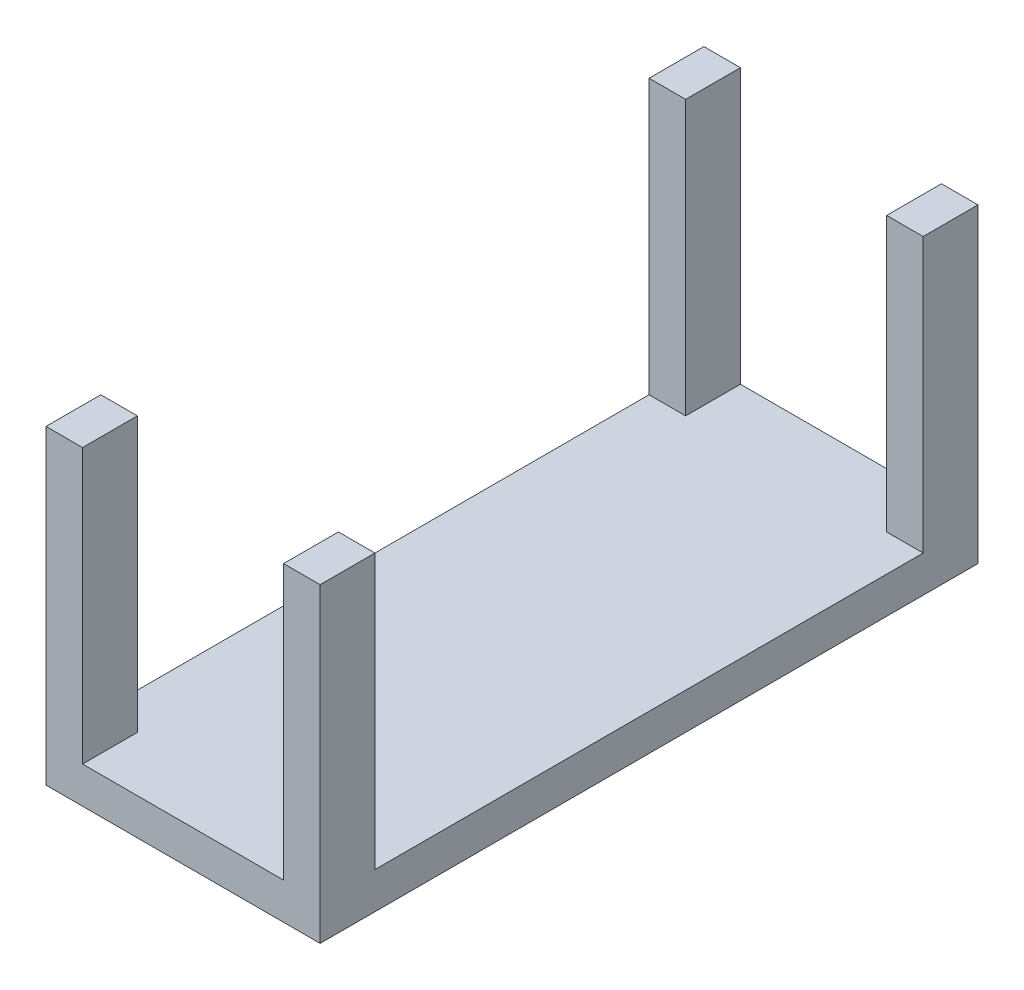
ISO-10303-21;
HEADER;
FILE_DESCRIPTION(('STEP AP214'),'2;1');
FILE_NAME('part.step','',(''),(''),'','','');
FILE_SCHEMA(('AUTOMOTIVE_DESIGN { 1 0 10303 214 1 1 1 1 }'));
ENDSEC;
DATA;
#1=APPLICATION_CONTEXT('core data for automotive mechanical design processes');
#2=APPLICATION_PROTOCOL_DEFINITION('international standard','automotive_design',2000,#1);
#3=PRODUCT_CONTEXT('',#1,'mechanical');
#4=PRODUCT('Part','Part','',(#3));
#5=PRODUCT_RELATED_PRODUCT_CATEGORY('part','',(#4));
#6=PRODUCT_DEFINITION_FORMATION('','',#4);
#7=PRODUCT_DEFINITION_CONTEXT('part definition',#1,'design');
#8=PRODUCT_DEFINITION('design','',#6,#7);
#9=PRODUCT_DEFINITION_SHAPE('','',#8);
#10=(LENGTH_UNIT() NAMED_UNIT(*) SI_UNIT(.MILLI.,.METRE.));
#11=(NAMED_UNIT(*) PLANE_ANGLE_UNIT() SI_UNIT($,.RADIAN.));
#12=(NAMED_UNIT(*) SI_UNIT($,.STERADIAN.) SOLID_ANGLE_UNIT());
#13=UNCERTAINTY_MEASURE_WITH_UNIT(LENGTH_MEASURE(1.E-05),#10,'distance_accuracy_value','');
#14=(GEOMETRIC_REPRESENTATION_CONTEXT(3) GLOBAL_UNCERTAINTY_ASSIGNED_CONTEXT((#13)) GLOBAL_UNIT_ASSIGNED_CONTEXT((#10,
#11,#12)) REPRESENTATION_CONTEXT('',''));
#15=CARTESIAN_POINT('',(0.,0.,0.));
#16=DIRECTION('',(0.,0.,1.));
#17=DIRECTION('',(1.,0.,0.));
#18=AXIS2_PLACEMENT_3D('',#15,#16,#17);
#19=CARTESIAN_POINT('',(7.5,8.5,36.));
#20=DIRECTION('',(0.,-1.,0.));
#21=DIRECTION('',(1.,0.,0.));
#22=AXIS2_PLACEMENT_3D('',#19,#20,#21);
#23=PLANE('',#22);
#24=DIRECTION('',(0.,0.,1.));
#25=VECTOR('',#24,1.);
#26=CARTESIAN_POINT('',(-5.5,8.5,36.));
#27=LINE('',#26,#25);
#28=CARTESIAN_POINT('',(-5.5,8.5,33.));
#29=VERTEX_POINT('',#28);
#30=CARTESIAN_POINT('',(-5.5,8.5,36.));
#31=VERTEX_POINT('',#30);
#32=EDGE_CURVE('E197',#29,#31,#27,.T.);
#33=ORIENTED_EDGE('',*,*,#32,.F.);
#34=DIRECTION('',(1.,0.,0.));
#35=VECTOR('',#34,1.);
#36=CARTESIAN_POINT('',(-7.5,8.5,33.));
#37=LINE('',#36,#35);
#38=CARTESIAN_POINT('',(-7.5,8.5,33.));
#39=VERTEX_POINT('',#38);
#40=EDGE_CURVE('E176',#39,#29,#37,.T.);
#41=ORIENTED_EDGE('',*,*,#40,.F.);
#42=DIRECTION('',(0.,0.,-1.));
#43=VECTOR('',#42,1.);
#44=CARTESIAN_POINT('',(-7.5,8.5,36.));
#45=LINE('',#44,#43);
#46=CARTESIAN_POINT('',(-7.5,8.5,36.));
#47=VERTEX_POINT('',#46);
#48=EDGE_CURVE('E249',#47,#39,#45,.T.);
#49=ORIENTED_EDGE('',*,*,#48,.F.);
#50=DIRECTION('',(-1.,0.,0.));
#51=VECTOR('',#50,1.);
#52=CARTESIAN_POINT('',(7.5,8.5,36.));
#53=LINE('',#52,#51);
#54=EDGE_CURVE('E234',#31,#47,#53,.T.);
#55=ORIENTED_EDGE('',*,*,#54,.F.);
#56=EDGE_LOOP('',(#33,#41,#49,#55));
#57=FACE_BOUND('',#56,.T.);
#58=ADVANCED_FACE('F35',(#57),#23,.F.);
#59=DIRECTION('',(0.,0.,-1.));
#60=VECTOR('',#59,1.);
#61=CARTESIAN_POINT('',(7.5,8.5,36.));
#62=LINE('',#61,#60);
#63=CARTESIAN_POINT('',(7.5,8.5,36.));
#64=VERTEX_POINT('',#63);
#65=CARTESIAN_POINT('',(7.5,8.5,33.));
#66=VERTEX_POINT('',#65);
#67=EDGE_CURVE('E253',#64,#66,#62,.T.);
#68=ORIENTED_EDGE('',*,*,#67,.T.);
#69=CARTESIAN_POINT('',(5.5,8.5,33.));
#70=VERTEX_POINT('',#69);
#71=EDGE_CURVE('E162',#70,#66,#37,.T.);
#72=ORIENTED_EDGE('',*,*,#71,.F.);
#73=DIRECTION('',(0.,0.,-1.));
#74=VECTOR('',#73,1.);
#75=CARTESIAN_POINT('',(5.5,8.5,36.));
#76=LINE('',#75,#74);
#77=CARTESIAN_POINT('',(5.5,8.5,36.));
#78=VERTEX_POINT('',#77);
#79=EDGE_CURVE('E213',#78,#70,#76,.T.);
#80=ORIENTED_EDGE('',*,*,#79,.F.);
#81=EDGE_CURVE('E235',#64,#78,#53,.T.);
#82=ORIENTED_EDGE('',*,*,#81,.F.);
#83=EDGE_LOOP('',(#68,#72,#80,#82));
#84=FACE_BOUND('',#83,.T.);
#85=ADVANCED_FACE('F311',(#84),#23,.F.);
#86=CARTESIAN_POINT('',(-5.5,-6.5,36.));
#87=DIRECTION('',(-1.,0.,0.));
#88=DIRECTION('',(0.,0.,1.));
#89=AXIS2_PLACEMENT_3D('',#86,#87,#88);
#90=PLANE('',#89);
#91=DIRECTION('',(0.,0.,1.));
#92=VECTOR('',#91,1.);
#93=CARTESIAN_POINT('',(-5.5,-6.5,36.));
#94=LINE('',#93,#92);
#95=CARTESIAN_POINT('',(-5.5,-6.5,33.));
#96=VERTEX_POINT('',#95);
#97=CARTESIAN_POINT('',(-5.5,-6.5,36.));
#98=VERTEX_POINT('',#97);
#99=EDGE_CURVE('E201',#96,#98,#94,.T.);
#100=ORIENTED_EDGE('',*,*,#99,.F.);
#101=DIRECTION('',(0.,1.,0.));
#102=VECTOR('',#101,1.);
#103=CARTESIAN_POINT('',(-5.5,-6.5,33.));
#104=LINE('',#103,#102);
#105=EDGE_CURVE('E194',#96,#29,#104,.T.);
#106=ORIENTED_EDGE('',*,*,#105,.T.);
#107=ORIENTED_EDGE('',*,*,#32,.T.);
#108=DIRECTION('',(0.,1.,0.));
#109=VECTOR('',#108,1.);
#110=CARTESIAN_POINT('',(-5.5,-6.5,36.));
#111=LINE('',#110,#109);
#112=EDGE_CURVE('E208',#98,#31,#111,.T.);
#113=ORIENTED_EDGE('',*,*,#112,.F.);
#114=EDGE_LOOP('',(#100,#106,#107,#113));
#115=FACE_BOUND('',#114,.T.);
#116=ADVANCED_FACE('F301',(#115),#90,.F.);
#117=CARTESIAN_POINT('',(5.5,-6.5,36.));
#118=DIRECTION('',(1.,0.,0.));
#119=DIRECTION('',(0.,0.,-1.));
#120=AXIS2_PLACEMENT_3D('',#117,#118,#119);
#121=PLANE('',#120);
#122=ORIENTED_EDGE('',*,*,#79,.T.);
#123=DIRECTION('',(0.,-1.,0.));
#124=VECTOR('',#123,1.);
#125=CARTESIAN_POINT('',(5.5,-6.5,33.));
#126=LINE('',#125,#124);
#127=CARTESIAN_POINT('',(5.5,-6.5,33.));
#128=VERTEX_POINT('',#127);
#129=EDGE_CURVE('E192',#70,#128,#126,.T.);
#130=ORIENTED_EDGE('',*,*,#129,.T.);
#131=DIRECTION('',(0.,0.,-1.));
#132=VECTOR('',#131,1.);
#133=CARTESIAN_POINT('',(5.5,-6.5,36.));
#134=LINE('',#133,#132);
#135=CARTESIAN_POINT('',(5.5,-6.5,36.));
#136=VERTEX_POINT('',#135);
#137=EDGE_CURVE('E153',#136,#128,#134,.T.);
#138=ORIENTED_EDGE('',*,*,#137,.F.);
#139=DIRECTION('',(0.,1.,0.));
#140=VECTOR('',#139,1.);
#141=CARTESIAN_POINT('',(5.5,-6.5,36.));
#142=LINE('',#141,#140);
#143=EDGE_CURVE('E222',#136,#78,#142,.T.);
#144=ORIENTED_EDGE('',*,*,#143,.T.);
#145=EDGE_LOOP('',(#122,#130,#138,#144));
#146=FACE_BOUND('',#145,.T.);
#147=ADVANCED_FACE('F309',(#146),#121,.F.);
#148=CARTESIAN_POINT('',(-7.5,8.5,3.));
#149=VERTEX_POINT('',#148);
#150=CARTESIAN_POINT('',(-7.5,8.5,0.));
#151=VERTEX_POINT('',#150);
#152=EDGE_CURVE('E238',#149,#151,#45,.T.);
#153=ORIENTED_EDGE('',*,*,#152,.F.);
#154=DIRECTION('',(-1.,0.,0.));
#155=VECTOR('',#154,1.);
#156=CARTESIAN_POINT('',(-7.5,8.5,3.));
#157=LINE('',#156,#155);
#158=CARTESIAN_POINT('',(-5.5,8.5,3.));
#159=VERTEX_POINT('',#158);
#160=EDGE_CURVE('E178',#159,#149,#157,.T.);
#161=ORIENTED_EDGE('',*,*,#160,.F.);
#162=CARTESIAN_POINT('',(-5.5,8.5,0.));
#163=VERTEX_POINT('',#162);
#164=EDGE_CURVE('E209',#163,#159,#27,.T.);
#165=ORIENTED_EDGE('',*,*,#164,.F.);
#166=DIRECTION('',(-1.,0.,0.));
#167=VECTOR('',#166,1.);
#168=CARTESIAN_POINT('',(7.5,8.5,0.));
#169=LINE('',#168,#167);
#170=EDGE_CURVE('E246',#163,#151,#169,.T.);
#171=ORIENTED_EDGE('',*,*,#170,.T.);
#172=EDGE_LOOP('',(#153,#161,#165,#171));
#173=FACE_BOUND('',#172,.T.);
#174=ADVANCED_FACE('F283',(#173),#23,.F.);
#175=CARTESIAN_POINT('',(-7.5,-8.5,36.));
#176=DIRECTION('',(1.,0.,0.));
#177=DIRECTION('',(0.,0.,-1.));
#178=AXIS2_PLACEMENT_3D('',#175,#176,#177);
#179=PLANE('',#178);
#180=ORIENTED_EDGE('',*,*,#48,.T.);
#181=DIRECTION('',(0.,1.,0.));
#182=VECTOR('',#181,1.);
#183=CARTESIAN_POINT('',(-7.5,-6.5,33.));
#184=LINE('',#183,#182);
#185=CARTESIAN_POINT('',(-7.5,-6.5,33.));
#186=VERTEX_POINT('',#185);
#187=EDGE_CURVE('E180',#186,#39,#184,.T.);
#188=ORIENTED_EDGE('',*,*,#187,.F.);
#189=DIRECTION('',(0.,0.,1.));
#190=VECTOR('',#189,1.);
#191=CARTESIAN_POINT('',(-7.5,-6.5,33.));
#192=LINE('',#191,#190);
#193=CARTESIAN_POINT('',(-7.5,-6.5,3.));
#194=VERTEX_POINT('',#193);
#195=EDGE_CURVE('E167',#194,#186,#192,.T.);
#196=ORIENTED_EDGE('',*,*,#195,.F.);
#197=DIRECTION('',(0.,1.,0.));
#198=VECTOR('',#197,1.);
#199=CARTESIAN_POINT('',(-7.5,-6.5,3.));
#200=LINE('',#199,#198);
#201=EDGE_CURVE('E183',#194,#149,#200,.T.);
#202=ORIENTED_EDGE('',*,*,#201,.T.);
#203=ORIENTED_EDGE('',*,*,#152,.T.);
#204=DIRECTION('',(0.,-1.,0.));
#205=VECTOR('',#204,1.);
#206=CARTESIAN_POINT('',(-7.5,-8.5,0.));
#207=LINE('',#206,#205);
#208=CARTESIAN_POINT('',(-7.5,-8.5,0.));
#209=VERTEX_POINT('',#208);
#210=EDGE_CURVE('E218',#151,#209,#207,.T.);
#211=ORIENTED_EDGE('',*,*,#210,.T.);
#212=DIRECTION('',(0.,0.,-1.));
#213=VECTOR('',#212,1.);
#214=CARTESIAN_POINT('',(-7.5,-8.5,36.));
#215=LINE('',#214,#213);
#216=CARTESIAN_POINT('',(-7.5,-8.5,36.));
#217=VERTEX_POINT('',#216);
#218=EDGE_CURVE('E11',#217,#209,#215,.T.);
#219=ORIENTED_EDGE('',*,*,#218,.F.);
#220=DIRECTION('',(0.,-1.,0.));
#221=VECTOR('',#220,1.);
#222=CARTESIAN_POINT('',(-7.5,-8.5,36.));
#223=LINE('',#222,#221);
#224=EDGE_CURVE('E226',#47,#217,#223,.T.);
#225=ORIENTED_EDGE('',*,*,#224,.F.);
#226=EDGE_LOOP('',(#180,#188,#196,#202,#203,#211,#219,#225));
#227=FACE_BOUND('',#226,.T.);
#228=ADVANCED_FACE('F37',(#227),#179,.F.);
#229=CARTESIAN_POINT('',(7.5,-8.5,36.));
#230=DIRECTION('',(0.,1.,0.));
#231=DIRECTION('',(-1.,0.,0.));
#232=AXIS2_PLACEMENT_3D('',#229,#230,#231);
#233=PLANE('',#232);
#234=DIRECTION('',(1.,0.,0.));
#235=VECTOR('',#234,1.);
#236=CARTESIAN_POINT('',(7.5,-8.5,0.));
#237=LINE('',#236,#235);
#238=CARTESIAN_POINT('',(7.5,-8.5,0.));
#239=VERTEX_POINT('',#238);
#240=EDGE_CURVE('E241',#209,#239,#237,.T.);
#241=ORIENTED_EDGE('',*,*,#240,.T.);
#242=DIRECTION('',(0.,0.,-1.));
#243=VECTOR('',#242,1.);
#244=CARTESIAN_POINT('',(7.5,-8.5,36.));
#245=LINE('',#244,#243);
#246=CARTESIAN_POINT('',(7.5,-8.5,36.));
#247=VERTEX_POINT('',#246);
#248=EDGE_CURVE('E43',#247,#239,#245,.T.);
#249=ORIENTED_EDGE('',*,*,#248,.F.);
#250=DIRECTION('',(1.,0.,0.));
#251=VECTOR('',#250,1.);
#252=CARTESIAN_POINT('',(7.5,-8.5,36.));
#253=LINE('',#252,#251);
#254=EDGE_CURVE('E229',#217,#247,#253,.T.);
#255=ORIENTED_EDGE('',*,*,#254,.F.);
#256=ORIENTED_EDGE('',*,*,#218,.T.);
#257=EDGE_LOOP('',(#241,#249,#255,#256));
#258=FACE_BOUND('',#257,.T.);
#259=ADVANCED_FACE('F326',(#258),#233,.F.);
#260=CARTESIAN_POINT('',(7.5,-8.5,36.));
#261=DIRECTION('',(-1.,0.,0.));
#262=DIRECTION('',(0.,0.,1.));
#263=AXIS2_PLACEMENT_3D('',#260,#261,#262);
#264=PLANE('',#263);
#265=DIRECTION('',(0.,0.,-1.));
#266=VECTOR('',#265,1.);
#267=CARTESIAN_POINT('',(7.5,-6.5,3.));
#268=LINE('',#267,#266);
#269=CARTESIAN_POINT('',(7.5,-6.5,33.));
#270=VERTEX_POINT('',#269);
#271=CARTESIAN_POINT('',(7.5,-6.5,3.));
#272=VERTEX_POINT('',#271);
#273=EDGE_CURVE('E150',#270,#272,#268,.T.);
#274=ORIENTED_EDGE('',*,*,#273,.F.);
#275=DIRECTION('',(0.,1.,0.));
#276=VECTOR('',#275,1.);
#277=CARTESIAN_POINT('',(7.5,-6.5,33.));
#278=LINE('',#277,#276);
#279=EDGE_CURVE('E159',#270,#66,#278,.T.);
#280=ORIENTED_EDGE('',*,*,#279,.T.);
#281=ORIENTED_EDGE('',*,*,#67,.F.);
#282=DIRECTION('',(0.,1.,0.));
#283=VECTOR('',#282,1.);
#284=CARTESIAN_POINT('',(7.5,-8.5,36.));
#285=LINE('',#284,#283);
#286=EDGE_CURVE('E232',#247,#64,#285,.T.);
#287=ORIENTED_EDGE('',*,*,#286,.F.);
#288=ORIENTED_EDGE('',*,*,#248,.T.);
#289=DIRECTION('',(0.,1.,0.));
#290=VECTOR('',#289,1.);
#291=CARTESIAN_POINT('',(7.5,-8.5,0.));
#292=LINE('',#291,#290);
#293=CARTESIAN_POINT('',(7.5,8.5,0.));
#294=VERTEX_POINT('',#293);
#295=EDGE_CURVE('E243',#239,#294,#292,.T.);
#296=ORIENTED_EDGE('',*,*,#295,.T.);
#297=CARTESIAN_POINT('',(7.5,8.5,3.));
#298=VERTEX_POINT('',#297);
#299=EDGE_CURVE('E252',#298,#294,#62,.T.);
#300=ORIENTED_EDGE('',*,*,#299,.F.);
#301=DIRECTION('',(0.,1.,0.));
#302=VECTOR('',#301,1.);
#303=CARTESIAN_POINT('',(7.5,-6.5,3.));
#304=LINE('',#303,#302);
#305=EDGE_CURVE('E166',#272,#298,#304,.T.);
#306=ORIENTED_EDGE('',*,*,#305,.F.);
#307=EDGE_LOOP('',(#274,#280,#281,#287,#288,#296,#300,#306));
#308=FACE_BOUND('',#307,.T.);
#309=ADVANCED_FACE('F169',(#308),#264,.F.);
#310=CARTESIAN_POINT('',(5.5,8.5,3.));
#311=VERTEX_POINT('',#310);
#312=CARTESIAN_POINT('',(5.5,8.5,0.));
#313=VERTEX_POINT('',#312);
#314=EDGE_CURVE('E212',#311,#313,#76,.T.);
#315=ORIENTED_EDGE('',*,*,#314,.F.);
#316=EDGE_CURVE('E156',#298,#311,#157,.T.);
#317=ORIENTED_EDGE('',*,*,#316,.F.);
#318=ORIENTED_EDGE('',*,*,#299,.T.);
#319=EDGE_CURVE('E230',#294,#313,#169,.T.);
#320=ORIENTED_EDGE('',*,*,#319,.T.);
#321=EDGE_LOOP('',(#315,#317,#318,#320));
#322=FACE_BOUND('',#321,.T.);
#323=ADVANCED_FACE('F268',(#322),#23,.F.);
#324=CARTESIAN_POINT('',(0.,0.,36.));
#325=DIRECTION('',(0.,0.,1.));
#326=DIRECTION('',(1.,0.,0.));
#327=AXIS2_PLACEMENT_3D('',#324,#325,#326);
#328=PLANE('',#327);
#329=ORIENTED_EDGE('',*,*,#112,.T.);
#330=ORIENTED_EDGE('',*,*,#54,.T.);
#331=ORIENTED_EDGE('',*,*,#224,.T.);
#332=ORIENTED_EDGE('',*,*,#254,.T.);
#333=ORIENTED_EDGE('',*,*,#286,.T.);
#334=ORIENTED_EDGE('',*,*,#81,.T.);
#335=ORIENTED_EDGE('',*,*,#143,.F.);
#336=DIRECTION('',(1.,0.,0.));
#337=VECTOR('',#336,1.);
#338=CARTESIAN_POINT('',(5.5,-6.5,36.));
#339=LINE('',#338,#337);
#340=EDGE_CURVE('E200',#98,#136,#339,.T.);
#341=ORIENTED_EDGE('',*,*,#340,.F.);
#342=EDGE_LOOP('',(#329,#330,#331,#332,#333,#334,#335,#341));
#343=FACE_BOUND('',#342,.T.);
#344=ADVANCED_FACE('F304',(#343),#328,.T.);
#345=CARTESIAN_POINT('',(0.,0.,0.));
#346=DIRECTION('',(0.,0.,1.));
#347=DIRECTION('',(1.,0.,0.));
#348=AXIS2_PLACEMENT_3D('',#345,#346,#347);
#349=PLANE('',#348);
#350=ORIENTED_EDGE('',*,*,#170,.F.);
#351=DIRECTION('',(0.,1.,0.));
#352=VECTOR('',#351,1.);
#353=CARTESIAN_POINT('',(-5.5,-6.5,0.));
#354=LINE('',#353,#352);
#355=CARTESIAN_POINT('',(-5.5,-6.5,0.));
#356=VERTEX_POINT('',#355);
#357=EDGE_CURVE('E216',#356,#163,#354,.T.);
#358=ORIENTED_EDGE('',*,*,#357,.F.);
#359=DIRECTION('',(-1.,0.,0.));
#360=VECTOR('',#359,1.);
#361=CARTESIAN_POINT('',(5.5,-6.5,0.));
#362=LINE('',#361,#360);
#363=CARTESIAN_POINT('',(5.5,-6.5,0.));
#364=VERTEX_POINT('',#363);
#365=EDGE_CURVE('E205',#364,#356,#362,.T.);
#366=ORIENTED_EDGE('',*,*,#365,.F.);
#367=DIRECTION('',(0.,1.,0.));
#368=VECTOR('',#367,1.);
#369=CARTESIAN_POINT('',(5.5,-6.5,0.));
#370=LINE('',#369,#368);
#371=EDGE_CURVE('E219',#364,#313,#370,.T.);
#372=ORIENTED_EDGE('',*,*,#371,.T.);
#373=ORIENTED_EDGE('',*,*,#319,.F.);
#374=ORIENTED_EDGE('',*,*,#295,.F.);
#375=ORIENTED_EDGE('',*,*,#240,.F.);
#376=ORIENTED_EDGE('',*,*,#210,.F.);
#377=EDGE_LOOP('',(#350,#358,#366,#372,#373,#374,#375,#376));
#378=FACE_BOUND('',#377,.T.);
#379=ADVANCED_FACE('F262',(#378),#349,.F.);
#380=ORIENTED_EDGE('',*,*,#164,.T.);
#381=DIRECTION('',(0.,-1.,0.));
#382=VECTOR('',#381,1.);
#383=CARTESIAN_POINT('',(-5.5,-6.5,3.));
#384=LINE('',#383,#382);
#385=CARTESIAN_POINT('',(-5.5,-6.5,3.));
#386=VERTEX_POINT('',#385);
#387=EDGE_CURVE('E189',#159,#386,#384,.T.);
#388=ORIENTED_EDGE('',*,*,#387,.T.);
#389=EDGE_CURVE('E198',#356,#386,#94,.T.);
#390=ORIENTED_EDGE('',*,*,#389,.F.);
#391=ORIENTED_EDGE('',*,*,#357,.T.);
#392=EDGE_LOOP('',(#380,#388,#390,#391));
#393=FACE_BOUND('',#392,.T.);
#394=ADVANCED_FACE('F279',(#393),#90,.F.);
#395=CARTESIAN_POINT('',(5.5,-6.5,3.));
#396=VERTEX_POINT('',#395);
#397=EDGE_CURVE('E203',#396,#364,#134,.T.);
#398=ORIENTED_EDGE('',*,*,#397,.F.);
#399=DIRECTION('',(0.,1.,0.));
#400=VECTOR('',#399,1.);
#401=CARTESIAN_POINT('',(5.5,-6.5,3.));
#402=LINE('',#401,#400);
#403=EDGE_CURVE('E182',#396,#311,#402,.T.);
#404=ORIENTED_EDGE('',*,*,#403,.T.);
#405=ORIENTED_EDGE('',*,*,#314,.T.);
#406=ORIENTED_EDGE('',*,*,#371,.F.);
#407=EDGE_LOOP('',(#398,#404,#405,#406));
#408=FACE_BOUND('',#407,.T.);
#409=ADVANCED_FACE('F274',(#408),#121,.F.);
#410=CARTESIAN_POINT('',(0.,-6.5,0.));
#411=DIRECTION('',(0.,1.,0.));
#412=DIRECTION('',(0.,0.,1.));
#413=AXIS2_PLACEMENT_3D('',#410,#411,#412);
#414=PLANE('',#413);
#415=ORIENTED_EDGE('',*,*,#389,.T.);
#416=DIRECTION('',(-1.,0.,0.));
#417=VECTOR('',#416,1.);
#418=CARTESIAN_POINT('',(-7.5,-6.5,3.));
#419=LINE('',#418,#417);
#420=EDGE_CURVE('E171',#386,#194,#419,.T.);
#421=ORIENTED_EDGE('',*,*,#420,.T.);
#422=ORIENTED_EDGE('',*,*,#195,.T.);
#423=DIRECTION('',(1.,0.,0.));
#424=VECTOR('',#423,1.);
#425=CARTESIAN_POINT('',(-7.5,-6.5,33.));
#426=LINE('',#425,#424);
#427=EDGE_CURVE('E57',#186,#96,#426,.T.);
#428=ORIENTED_EDGE('',*,*,#427,.T.);
#429=ORIENTED_EDGE('',*,*,#99,.T.);
#430=ORIENTED_EDGE('',*,*,#340,.T.);
#431=ORIENTED_EDGE('',*,*,#137,.T.);
#432=EDGE_CURVE('E145',#128,#270,#426,.T.);
#433=ORIENTED_EDGE('',*,*,#432,.T.);
#434=ORIENTED_EDGE('',*,*,#273,.T.);
#435=EDGE_CURVE('E50',#272,#396,#419,.T.);
#436=ORIENTED_EDGE('',*,*,#435,.T.);
#437=ORIENTED_EDGE('',*,*,#397,.T.);
#438=ORIENTED_EDGE('',*,*,#365,.T.);
#439=EDGE_LOOP('',(#415,#421,#422,#428,#429,#430,#431,#433,#434,#436,#437,#438));
#440=FACE_BOUND('',#439,.T.);
#441=ADVANCED_FACE('F148',(#440),#414,.T.);
#442=CARTESIAN_POINT('',(-7.5,-6.5,3.));
#443=DIRECTION('',(0.,0.,-1.));
#444=DIRECTION('',(-1.,0.,0.));
#445=AXIS2_PLACEMENT_3D('',#442,#443,#444);
#446=PLANE('',#445);
#447=ORIENTED_EDGE('',*,*,#435,.F.);
#448=ORIENTED_EDGE('',*,*,#305,.T.);
#449=ORIENTED_EDGE('',*,*,#316,.T.);
#450=ORIENTED_EDGE('',*,*,#403,.F.);
#451=EDGE_LOOP('',(#447,#448,#449,#450));
#452=FACE_BOUND('',#451,.T.);
#453=ADVANCED_FACE('F271',(#452),#446,.F.);
#454=CARTESIAN_POINT('',(-7.5,-6.5,33.));
#455=DIRECTION('',(0.,0.,1.));
#456=DIRECTION('',(1.,0.,0.));
#457=AXIS2_PLACEMENT_3D('',#454,#455,#456);
#458=PLANE('',#457);
#459=ORIENTED_EDGE('',*,*,#71,.T.);
#460=ORIENTED_EDGE('',*,*,#279,.F.);
#461=ORIENTED_EDGE('',*,*,#432,.F.);
#462=ORIENTED_EDGE('',*,*,#129,.F.);
#463=EDGE_LOOP('',(#459,#460,#461,#462));
#464=FACE_BOUND('',#463,.T.);
#465=ADVANCED_FACE('F160',(#464),#458,.F.);
#466=ORIENTED_EDGE('',*,*,#427,.F.);
#467=ORIENTED_EDGE('',*,*,#187,.T.);
#468=ORIENTED_EDGE('',*,*,#40,.T.);
#469=ORIENTED_EDGE('',*,*,#105,.F.);
#470=EDGE_LOOP('',(#466,#467,#468,#469));
#471=FACE_BOUND('',#470,.T.);
#472=ADVANCED_FACE('F294',(#471),#458,.F.);
#473=ORIENTED_EDGE('',*,*,#160,.T.);
#474=ORIENTED_EDGE('',*,*,#201,.F.);
#475=ORIENTED_EDGE('',*,*,#420,.F.);
#476=ORIENTED_EDGE('',*,*,#387,.F.);
#477=EDGE_LOOP('',(#473,#474,#475,#476));
#478=FACE_BOUND('',#477,.T.);
#479=ADVANCED_FACE('F286',(#478),#446,.F.);
#480=CLOSED_SHELL('',(#58,#85,#116,#147,#174,#228,#259,#309,#323,#344,#379,#394,#409,#441,#453,
#465,#472,#479));
#481=MANIFOLD_SOLID_BREP('B2',#480);
#482=ADVANCED_BREP_SHAPE_REPRESENTATION('',(#18,#481),#14);
#483=SHAPE_DEFINITION_REPRESENTATION(#9,#482);
ENDSEC;
END-ISO-10303-21;
